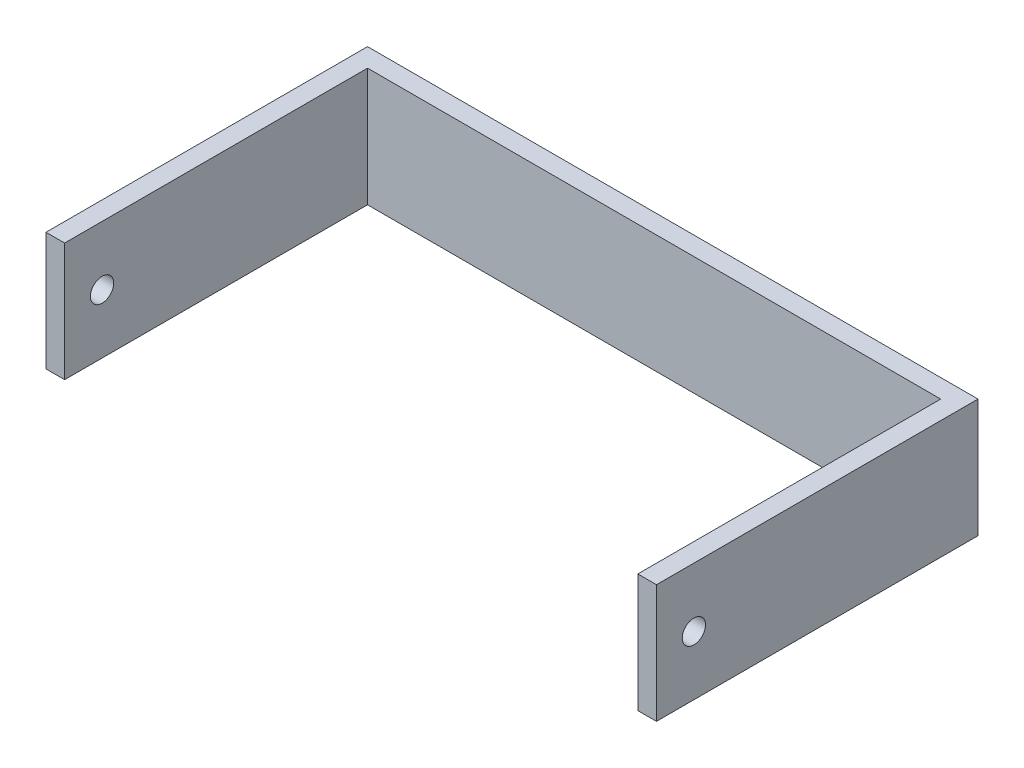
ISO-10303-21;
HEADER;
FILE_DESCRIPTION(('STEP AP214'),'2;1');
FILE_NAME('part.step','',(''),(''),'','','');
FILE_SCHEMA(('AUTOMOTIVE_DESIGN { 1 0 10303 214 1 1 1 1 }'));
ENDSEC;
DATA;
#1=APPLICATION_CONTEXT('core data for automotive mechanical design processes');
#2=APPLICATION_PROTOCOL_DEFINITION('international standard','automotive_design',2000,#1);
#3=PRODUCT_CONTEXT('',#1,'mechanical');
#4=PRODUCT('Part','Part','',(#3));
#5=PRODUCT_RELATED_PRODUCT_CATEGORY('part','',(#4));
#6=PRODUCT_DEFINITION_FORMATION('','',#4);
#7=PRODUCT_DEFINITION_CONTEXT('part definition',#1,'design');
#8=PRODUCT_DEFINITION('design','',#6,#7);
#9=PRODUCT_DEFINITION_SHAPE('','',#8);
#10=(LENGTH_UNIT() NAMED_UNIT(*) SI_UNIT(.MILLI.,.METRE.));
#11=(NAMED_UNIT(*) PLANE_ANGLE_UNIT() SI_UNIT($,.RADIAN.));
#12=(NAMED_UNIT(*) SI_UNIT($,.STERADIAN.) SOLID_ANGLE_UNIT());
#13=UNCERTAINTY_MEASURE_WITH_UNIT(LENGTH_MEASURE(1.E-05),#10,'distance_accuracy_value','');
#14=(GEOMETRIC_REPRESENTATION_CONTEXT(3) GLOBAL_UNCERTAINTY_ASSIGNED_CONTEXT((#13)) GLOBAL_UNIT_ASSIGNED_CONTEXT((#10,
#11,#12)) REPRESENTATION_CONTEXT('',''));
#15=CARTESIAN_POINT('',(0.,0.,0.));
#16=DIRECTION('',(0.,0.,1.));
#17=DIRECTION('',(1.,0.,0.));
#18=AXIS2_PLACEMENT_3D('',#15,#16,#17);
#19=CARTESIAN_POINT('',(-71.7178391103408,25.4,0.));
#20=DIRECTION('',(-1.,0.,0.));
#21=DIRECTION('',(0.,0.,1.));
#22=AXIS2_PLACEMENT_3D('',#19,#20,#21);
#23=PLANE('',#22);
#24=CARTESIAN_POINT('',(-71.7178391103408,12.7,56.9692315921239));
#25=DIRECTION('',(-1.,0.,0.));
#26=DIRECTION('',(0.,0.,1.));
#27=AXIS2_PLACEMENT_3D('',#24,#25,#26);
#28=CIRCLE('',#27,2.5);
#29=CARTESIAN_POINT('',(-71.7178391103408,12.7,59.4692315921239));
#30=VERTEX_POINT('',#29);
#31=EDGE_CURVE('E133',#30,#30,#28,.T.);
#32=ORIENTED_EDGE('',*,*,#31,.T.);
#33=EDGE_LOOP('',(#32));
#34=FACE_BOUND('',#33,.T.);
#35=DIRECTION('',(0.,0.,-1.));
#36=VECTOR('',#35,1.);
#37=CARTESIAN_POINT('',(-71.7178391103408,0.,0.));
#38=LINE('',#37,#36);
#39=CARTESIAN_POINT('',(-71.7178391103408,0.,65.));
#40=VERTEX_POINT('',#39);
#41=CARTESIAN_POINT('',(-71.7178391103408,0.,0.));
#42=VERTEX_POINT('',#41);
#43=EDGE_CURVE('E129',#40,#42,#38,.T.);
#44=ORIENTED_EDGE('',*,*,#43,.T.);
#45=DIRECTION('',(0.,-1.,0.));
#46=VECTOR('',#45,1.);
#47=CARTESIAN_POINT('',(-71.7178391103408,25.4,0.));
#48=LINE('',#47,#46);
#49=CARTESIAN_POINT('',(-71.7178391103408,25.4,0.));
#50=VERTEX_POINT('',#49);
#51=EDGE_CURVE('E11',#50,#42,#48,.T.);
#52=ORIENTED_EDGE('',*,*,#51,.F.);
#53=DIRECTION('',(0.,0.,-1.));
#54=VECTOR('',#53,1.);
#55=CARTESIAN_POINT('',(-71.7178391103408,25.4,0.));
#56=LINE('',#55,#54);
#57=CARTESIAN_POINT('',(-71.7178391103408,25.4,65.));
#58=VERTEX_POINT('',#57);
#59=EDGE_CURVE('E144',#58,#50,#56,.T.);
#60=ORIENTED_EDGE('',*,*,#59,.F.);
#61=DIRECTION('',(0.,-1.,0.));
#62=VECTOR('',#61,1.);
#63=CARTESIAN_POINT('',(-71.7178391103408,25.4,65.));
#64=LINE('',#63,#62);
#65=EDGE_CURVE('E125',#58,#40,#64,.T.);
#66=ORIENTED_EDGE('',*,*,#65,.T.);
#67=EDGE_LOOP('',(#44,#52,#60,#66));
#68=FACE_BOUND('',#67,.T.);
#69=ADVANCED_FACE('F33',(#34,#68),#23,.F.);
#70=CARTESIAN_POINT('',(-71.7178391103408,25.4,0.));
#71=DIRECTION('',(0.,0.,-1.));
#72=DIRECTION('',(-1.,0.,0.));
#73=AXIS2_PLACEMENT_3D('',#70,#71,#72);
#74=PLANE('',#73);
#75=DIRECTION('',(1.,0.,0.));
#76=VECTOR('',#75,1.);
#77=CARTESIAN_POINT('',(-71.7178391103408,0.,0.));
#78=LINE('',#77,#76);
#79=CARTESIAN_POINT('',(51.2821608896592,0.,0.));
#80=VERTEX_POINT('',#79);
#81=EDGE_CURVE('E132',#42,#80,#78,.T.);
#82=ORIENTED_EDGE('',*,*,#81,.T.);
#83=DIRECTION('',(0.,-1.,0.));
#84=VECTOR('',#83,1.);
#85=CARTESIAN_POINT('',(51.2821608896592,25.4,0.));
#86=LINE('',#85,#84);
#87=CARTESIAN_POINT('',(51.2821608896592,25.4,0.));
#88=VERTEX_POINT('',#87);
#89=EDGE_CURVE('E41',#88,#80,#86,.T.);
#90=ORIENTED_EDGE('',*,*,#89,.F.);
#91=DIRECTION('',(1.,0.,0.));
#92=VECTOR('',#91,1.);
#93=CARTESIAN_POINT('',(-71.7178391103408,25.4,0.));
#94=LINE('',#93,#92);
#95=EDGE_CURVE('E92',#50,#88,#94,.T.);
#96=ORIENTED_EDGE('',*,*,#95,.F.);
#97=ORIENTED_EDGE('',*,*,#51,.T.);
#98=EDGE_LOOP('',(#82,#90,#96,#97));
#99=FACE_BOUND('',#98,.T.);
#100=ADVANCED_FACE('F199',(#99),#74,.F.);
#101=CARTESIAN_POINT('',(51.2821608896592,25.4,0.));
#102=DIRECTION('',(1.,0.,0.));
#103=DIRECTION('',(0.,0.,-1.));
#104=AXIS2_PLACEMENT_3D('',#101,#102,#103);
#105=PLANE('',#104);
#106=CARTESIAN_POINT('',(51.2821608896592,12.7,56.9692315921239));
#107=DIRECTION('',(1.,0.,0.));
#108=DIRECTION('',(0.,0.,-1.));
#109=AXIS2_PLACEMENT_3D('',#106,#107,#108);
#110=CIRCLE('',#109,2.5);
#111=CARTESIAN_POINT('',(51.2821608896592,12.7,54.4692315921239));
#112=VERTEX_POINT('',#111);
#113=EDGE_CURVE('E179',#112,#112,#110,.T.);
#114=ORIENTED_EDGE('',*,*,#113,.T.);
#115=EDGE_LOOP('',(#114));
#116=FACE_BOUND('',#115,.T.);
#117=DIRECTION('',(0.,0.,1.));
#118=VECTOR('',#117,1.);
#119=CARTESIAN_POINT('',(51.2821608896592,0.,0.));
#120=LINE('',#119,#118);
#121=CARTESIAN_POINT('',(51.2821608896592,0.,65.));
#122=VERTEX_POINT('',#121);
#123=EDGE_CURVE('E135',#80,#122,#120,.T.);
#124=ORIENTED_EDGE('',*,*,#123,.T.);
#125=DIRECTION('',(0.,-1.,0.));
#126=VECTOR('',#125,1.);
#127=CARTESIAN_POINT('',(51.2821608896592,25.4,65.));
#128=LINE('',#127,#126);
#129=CARTESIAN_POINT('',(51.2821608896592,25.4,65.));
#130=VERTEX_POINT('',#129);
#131=EDGE_CURVE('E151',#130,#122,#128,.T.);
#132=ORIENTED_EDGE('',*,*,#131,.F.);
#133=DIRECTION('',(0.,0.,1.));
#134=VECTOR('',#133,1.);
#135=CARTESIAN_POINT('',(51.2821608896592,25.4,0.));
#136=LINE('',#135,#134);
#137=EDGE_CURVE('E159',#88,#130,#136,.T.);
#138=ORIENTED_EDGE('',*,*,#137,.F.);
#139=ORIENTED_EDGE('',*,*,#89,.T.);
#140=EDGE_LOOP('',(#124,#132,#138,#139));
#141=FACE_BOUND('',#140,.T.);
#142=ADVANCED_FACE('F157',(#116,#141),#105,.F.);
#143=CARTESIAN_POINT('',(51.2821608896592,25.4,65.));
#144=DIRECTION('',(0.,0.,-1.));
#145=DIRECTION('',(-1.,0.,0.));
#146=AXIS2_PLACEMENT_3D('',#143,#144,#145);
#147=PLANE('',#146);
#148=DIRECTION('',(1.,0.,0.));
#149=VECTOR('',#148,1.);
#150=CARTESIAN_POINT('',(51.2821608896592,0.,65.));
#151=LINE('',#150,#149);
#152=CARTESIAN_POINT('',(55.2821608896592,0.,65.));
#153=VERTEX_POINT('',#152);
#154=EDGE_CURVE('E137',#122,#153,#151,.T.);
#155=ORIENTED_EDGE('',*,*,#154,.T.);
#156=DIRECTION('',(0.,-1.,0.));
#157=VECTOR('',#156,1.);
#158=CARTESIAN_POINT('',(55.2821608896592,25.4,65.));
#159=LINE('',#158,#157);
#160=CARTESIAN_POINT('',(55.2821608896592,25.4,65.));
#161=VERTEX_POINT('',#160);
#162=EDGE_CURVE('E148',#161,#153,#159,.T.);
#163=ORIENTED_EDGE('',*,*,#162,.F.);
#164=DIRECTION('',(1.,0.,0.));
#165=VECTOR('',#164,1.);
#166=CARTESIAN_POINT('',(51.2821608896592,25.4,65.));
#167=LINE('',#166,#165);
#168=EDGE_CURVE('E171',#130,#161,#167,.T.);
#169=ORIENTED_EDGE('',*,*,#168,.F.);
#170=ORIENTED_EDGE('',*,*,#131,.T.);
#171=EDGE_LOOP('',(#155,#163,#169,#170));
#172=FACE_BOUND('',#171,.T.);
#173=ADVANCED_FACE('F167',(#172),#147,.F.);
#174=CARTESIAN_POINT('',(55.2821608896592,25.4,65.));
#175=DIRECTION('',(-1.,0.,0.));
#176=DIRECTION('',(0.,0.,1.));
#177=AXIS2_PLACEMENT_3D('',#174,#175,#176);
#178=PLANE('',#177);
#179=CARTESIAN_POINT('',(55.2821608896592,12.7,56.9692315921239));
#180=DIRECTION('',(-1.,0.,0.));
#181=DIRECTION('',(0.,0.,1.));
#182=AXIS2_PLACEMENT_3D('',#179,#180,#181);
#183=CIRCLE('',#182,2.5);
#184=CARTESIAN_POINT('',(55.2821608896592,12.7,59.4692315921239));
#185=VERTEX_POINT('',#184);
#186=EDGE_CURVE('E182',#185,#185,#183,.T.);
#187=ORIENTED_EDGE('',*,*,#186,.T.);
#188=EDGE_LOOP('',(#187));
#189=FACE_BOUND('',#188,.T.);
#190=DIRECTION('',(0.,0.,-1.));
#191=VECTOR('',#190,1.);
#192=CARTESIAN_POINT('',(55.2821608896592,0.,65.));
#193=LINE('',#192,#191);
#194=CARTESIAN_POINT('',(55.2821608896592,0.,-4.));
#195=VERTEX_POINT('',#194);
#196=EDGE_CURVE('E139',#153,#195,#193,.T.);
#197=ORIENTED_EDGE('',*,*,#196,.T.);
#198=DIRECTION('',(0.,-1.,0.));
#199=VECTOR('',#198,1.);
#200=CARTESIAN_POINT('',(55.2821608896592,25.4,-4.));
#201=LINE('',#200,#199);
#202=CARTESIAN_POINT('',(55.2821608896592,25.4,-4.));
#203=VERTEX_POINT('',#202);
#204=EDGE_CURVE('E120',#203,#195,#201,.T.);
#205=ORIENTED_EDGE('',*,*,#204,.F.);
#206=DIRECTION('',(0.,0.,-1.));
#207=VECTOR('',#206,1.);
#208=CARTESIAN_POINT('',(55.2821608896592,25.4,65.));
#209=LINE('',#208,#207);
#210=EDGE_CURVE('E111',#161,#203,#209,.T.);
#211=ORIENTED_EDGE('',*,*,#210,.F.);
#212=ORIENTED_EDGE('',*,*,#162,.T.);
#213=EDGE_LOOP('',(#197,#205,#211,#212));
#214=FACE_BOUND('',#213,.T.);
#215=ADVANCED_FACE('F170',(#189,#214),#178,.F.);
#216=CARTESIAN_POINT('',(-75.7178391103408,25.4,-4.));
#217=DIRECTION('',(0.,0.,1.));
#218=DIRECTION('',(1.,0.,0.));
#219=AXIS2_PLACEMENT_3D('',#216,#217,#218);
#220=PLANE('',#219);
#221=DIRECTION('',(-1.,0.,0.));
#222=VECTOR('',#221,1.);
#223=CARTESIAN_POINT('',(-75.7178391103408,0.,-4.));
#224=LINE('',#223,#222);
#225=CARTESIAN_POINT('',(-75.7178391103408,0.,-4.));
#226=VERTEX_POINT('',#225);
#227=EDGE_CURVE('E119',#195,#226,#224,.T.);
#228=ORIENTED_EDGE('',*,*,#227,.T.);
#229=DIRECTION('',(0.,-1.,0.));
#230=VECTOR('',#229,1.);
#231=CARTESIAN_POINT('',(-75.7178391103408,25.4,-4.));
#232=LINE('',#231,#230);
#233=CARTESIAN_POINT('',(-75.7178391103408,25.4,-4.));
#234=VERTEX_POINT('',#233);
#235=EDGE_CURVE('E116',#234,#226,#232,.T.);
#236=ORIENTED_EDGE('',*,*,#235,.F.);
#237=DIRECTION('',(-1.,0.,0.));
#238=VECTOR('',#237,1.);
#239=CARTESIAN_POINT('',(-75.7178391103408,25.4,-4.));
#240=LINE('',#239,#238);
#241=EDGE_CURVE('E105',#203,#234,#240,.T.);
#242=ORIENTED_EDGE('',*,*,#241,.F.);
#243=ORIENTED_EDGE('',*,*,#204,.T.);
#244=EDGE_LOOP('',(#228,#236,#242,#243));
#245=FACE_BOUND('',#244,.T.);
#246=ADVANCED_FACE('F117',(#245),#220,.F.);
#247=CARTESIAN_POINT('',(-75.7178391103408,25.4,65.));
#248=DIRECTION('',(1.,0.,0.));
#249=DIRECTION('',(0.,0.,-1.));
#250=AXIS2_PLACEMENT_3D('',#247,#248,#249);
#251=PLANE('',#250);
#252=CARTESIAN_POINT('',(-75.7178391103408,12.7,56.9692315921239));
#253=DIRECTION('',(1.,0.,0.));
#254=DIRECTION('',(0.,0.,-1.));
#255=AXIS2_PLACEMENT_3D('',#252,#253,#254);
#256=CIRCLE('',#255,2.5);
#257=CARTESIAN_POINT('',(-75.7178391103408,12.7,54.4692315921239));
#258=VERTEX_POINT('',#257);
#259=EDGE_CURVE('E185',#258,#258,#256,.T.);
#260=ORIENTED_EDGE('',*,*,#259,.T.);
#261=EDGE_LOOP('',(#260));
#262=FACE_BOUND('',#261,.T.);
#263=DIRECTION('',(0.,0.,1.));
#264=VECTOR('',#263,1.);
#265=CARTESIAN_POINT('',(-75.7178391103408,0.,65.));
#266=LINE('',#265,#264);
#267=CARTESIAN_POINT('',(-75.7178391103408,0.,65.));
#268=VERTEX_POINT('',#267);
#269=EDGE_CURVE('E78',#226,#268,#266,.T.);
#270=ORIENTED_EDGE('',*,*,#269,.T.);
#271=DIRECTION('',(0.,-1.,0.));
#272=VECTOR('',#271,1.);
#273=CARTESIAN_POINT('',(-75.7178391103408,25.4,65.));
#274=LINE('',#273,#272);
#275=CARTESIAN_POINT('',(-75.7178391103408,25.4,65.));
#276=VERTEX_POINT('',#275);
#277=EDGE_CURVE('E121',#276,#268,#274,.T.);
#278=ORIENTED_EDGE('',*,*,#277,.F.);
#279=DIRECTION('',(0.,0.,1.));
#280=VECTOR('',#279,1.);
#281=CARTESIAN_POINT('',(-75.7178391103408,25.4,65.));
#282=LINE('',#281,#280);
#283=EDGE_CURVE('E109',#234,#276,#282,.T.);
#284=ORIENTED_EDGE('',*,*,#283,.F.);
#285=ORIENTED_EDGE('',*,*,#235,.T.);
#286=EDGE_LOOP('',(#270,#278,#284,#285));
#287=FACE_BOUND('',#286,.T.);
#288=ADVANCED_FACE('F123',(#262,#287),#251,.F.);
#289=CARTESIAN_POINT('',(-71.7178391103408,25.4,65.));
#290=DIRECTION('',(0.,0.,-1.));
#291=DIRECTION('',(-1.,0.,0.));
#292=AXIS2_PLACEMENT_3D('',#289,#290,#291);
#293=PLANE('',#292);
#294=DIRECTION('',(1.,0.,0.));
#295=VECTOR('',#294,1.);
#296=CARTESIAN_POINT('',(-71.7178391103408,0.,65.));
#297=LINE('',#296,#295);
#298=EDGE_CURVE('E84',#268,#40,#297,.T.);
#299=ORIENTED_EDGE('',*,*,#298,.T.);
#300=ORIENTED_EDGE('',*,*,#65,.F.);
#301=DIRECTION('',(1.,0.,0.));
#302=VECTOR('',#301,1.);
#303=CARTESIAN_POINT('',(-71.7178391103408,25.4,65.));
#304=LINE('',#303,#302);
#305=EDGE_CURVE('E49',#276,#58,#304,.T.);
#306=ORIENTED_EDGE('',*,*,#305,.F.);
#307=ORIENTED_EDGE('',*,*,#277,.T.);
#308=EDGE_LOOP('',(#299,#300,#306,#307));
#309=FACE_BOUND('',#308,.T.);
#310=ADVANCED_FACE('F202',(#309),#293,.F.);
#311=CARTESIAN_POINT('',(0.,25.4,0.));
#312=DIRECTION('',(0.,-1.,0.));
#313=DIRECTION('',(0.,0.,-1.));
#314=AXIS2_PLACEMENT_3D('',#311,#312,#313);
#315=PLANE('',#314);
#316=ORIENTED_EDGE('',*,*,#59,.T.);
#317=ORIENTED_EDGE('',*,*,#95,.T.);
#318=ORIENTED_EDGE('',*,*,#137,.T.);
#319=ORIENTED_EDGE('',*,*,#168,.T.);
#320=ORIENTED_EDGE('',*,*,#210,.T.);
#321=ORIENTED_EDGE('',*,*,#241,.T.);
#322=ORIENTED_EDGE('',*,*,#283,.T.);
#323=ORIENTED_EDGE('',*,*,#305,.T.);
#324=EDGE_LOOP('',(#316,#317,#318,#319,#320,#321,#322,#323));
#325=FACE_BOUND('',#324,.T.);
#326=ADVANCED_FACE('F107',(#325),#315,.F.);
#327=CARTESIAN_POINT('',(0.,0.,0.));
#328=DIRECTION('',(0.,-1.,0.));
#329=DIRECTION('',(0.,0.,-1.));
#330=AXIS2_PLACEMENT_3D('',#327,#328,#329);
#331=PLANE('',#330);
#332=ORIENTED_EDGE('',*,*,#43,.F.);
#333=ORIENTED_EDGE('',*,*,#298,.F.);
#334=ORIENTED_EDGE('',*,*,#269,.F.);
#335=ORIENTED_EDGE('',*,*,#227,.F.);
#336=ORIENTED_EDGE('',*,*,#196,.F.);
#337=ORIENTED_EDGE('',*,*,#154,.F.);
#338=ORIENTED_EDGE('',*,*,#123,.F.);
#339=ORIENTED_EDGE('',*,*,#81,.F.);
#340=EDGE_LOOP('',(#332,#333,#334,#335,#336,#337,#338,#339));
#341=FACE_BOUND('',#340,.T.);
#342=ADVANCED_FACE('F163',(#341),#331,.T.);
#343=CARTESIAN_POINT('',(-75.7178391103408,12.7,56.9692315921239));
#344=DIRECTION('',(1.,0.,0.));
#345=DIRECTION('',(0.,0.,-1.));
#346=AXIS2_PLACEMENT_3D('',#343,#344,#345);
#347=CYLINDRICAL_SURFACE('',#346,2.5);
#348=ORIENTED_EDGE('',*,*,#259,.F.);
#349=EDGE_LOOP('',(#348));
#350=FACE_BOUND('',#349,.T.);
#351=ORIENTED_EDGE('',*,*,#31,.F.);
#352=EDGE_LOOP('',(#351));
#353=FACE_BOUND('',#352,.T.);
#354=ADVANCED_FACE('F190',(#350,#353),#347,.F.);
#355=ORIENTED_EDGE('',*,*,#186,.F.);
#356=EDGE_LOOP('',(#355));
#357=FACE_BOUND('',#356,.T.);
#358=ORIENTED_EDGE('',*,*,#113,.F.);
#359=EDGE_LOOP('',(#358));
#360=FACE_BOUND('',#359,.T.);
#361=ADVANCED_FACE('F193',(#357,#360),#347,.F.);
#362=CLOSED_SHELL('',(#69,#100,#142,#173,#215,#246,#288,#310,#326,#342,#354,#361));
#363=MANIFOLD_SOLID_BREP('B2',#362);
#364=ADVANCED_BREP_SHAPE_REPRESENTATION('',(#18,#363),#14);
#365=SHAPE_DEFINITION_REPRESENTATION(#9,#364);
ENDSEC;
END-ISO-10303-21;
